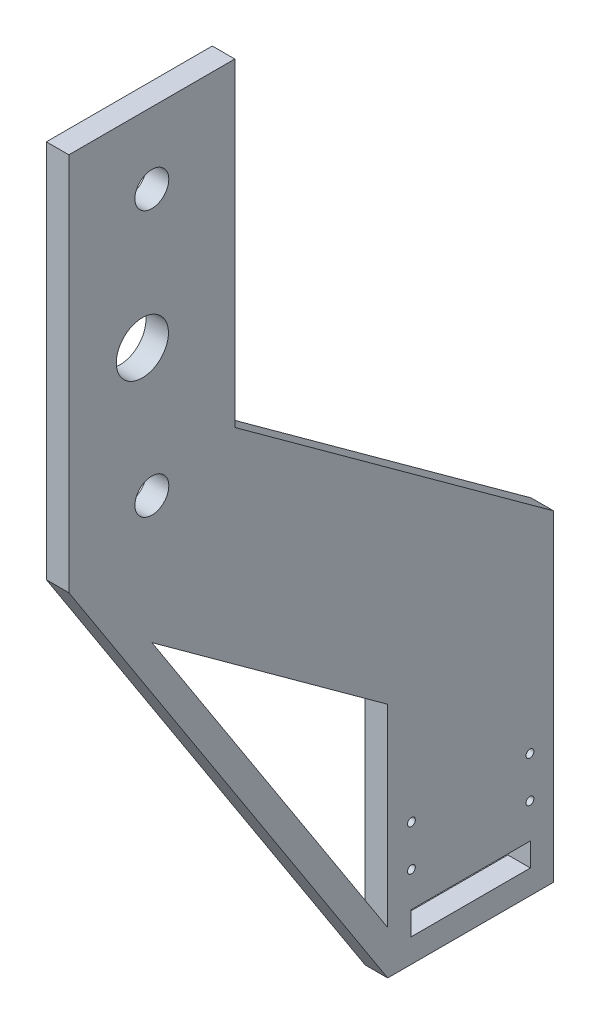
ISO-10303-21;
HEADER;
FILE_DESCRIPTION(('STEP AP214'),'2;1');
FILE_NAME('part.step','',(''),(''),'','','');
FILE_SCHEMA(('AUTOMOTIVE_DESIGN { 1 0 10303 214 1 1 1 1 }'));
ENDSEC;
DATA;
#1=APPLICATION_CONTEXT('core data for automotive mechanical design processes');
#2=APPLICATION_PROTOCOL_DEFINITION('international standard','automotive_design',2000,#1);
#3=PRODUCT_CONTEXT('',#1,'mechanical');
#4=PRODUCT('Part','Part','',(#3));
#5=PRODUCT_RELATED_PRODUCT_CATEGORY('part','',(#4));
#6=PRODUCT_DEFINITION_FORMATION('','',#4);
#7=PRODUCT_DEFINITION_CONTEXT('part definition',#1,'design');
#8=PRODUCT_DEFINITION('design','',#6,#7);
#9=PRODUCT_DEFINITION_SHAPE('','',#8);
#10=(LENGTH_UNIT() NAMED_UNIT(*) SI_UNIT(.MILLI.,.METRE.));
#11=(NAMED_UNIT(*) PLANE_ANGLE_UNIT() SI_UNIT($,.RADIAN.));
#12=(NAMED_UNIT(*) SI_UNIT($,.STERADIAN.) SOLID_ANGLE_UNIT());
#13=UNCERTAINTY_MEASURE_WITH_UNIT(LENGTH_MEASURE(1.E-05),#10,'distance_accuracy_value','');
#14=(GEOMETRIC_REPRESENTATION_CONTEXT(3) GLOBAL_UNCERTAINTY_ASSIGNED_CONTEXT((#13)) GLOBAL_UNIT_ASSIGNED_CONTEXT((#10,
#11,#12)) REPRESENTATION_CONTEXT('',''));
#15=CARTESIAN_POINT('',(0.,0.,0.));
#16=DIRECTION('',(0.,0.,1.));
#17=DIRECTION('',(1.,0.,0.));
#18=AXIS2_PLACEMENT_3D('',#15,#16,#17);
#19=CARTESIAN_POINT('',(9.5,0.,0.));
#20=DIRECTION('',(1.,0.,0.));
#21=DIRECTION('',(0.,0.,-1.));
#22=AXIS2_PLACEMENT_3D('',#19,#20,#21);
#23=PLANE('',#22);
#24=CARTESIAN_POINT('',(9.5,34.7,-10.));
#25=DIRECTION('',(1.,0.,0.));
#26=DIRECTION('',(0.,0.,-1.));
#27=AXIS2_PLACEMENT_3D('',#24,#25,#26);
#28=CIRCLE('',#27,1.64999999999999);
#29=CARTESIAN_POINT('',(9.5,34.7,-11.65));
#30=VERTEX_POINT('',#29);
#31=EDGE_CURVE('E422',#30,#30,#28,.T.);
#32=ORIENTED_EDGE('',*,*,#31,.F.);
#33=EDGE_LOOP('',(#32));
#34=FACE_BOUND('',#33,.T.);
#35=CARTESIAN_POINT('',(9.5,52.,-10.));
#36=DIRECTION('',(1.,0.,0.));
#37=DIRECTION('',(0.,0.,-1.));
#38=AXIS2_PLACEMENT_3D('',#35,#36,#37);
#39=CIRCLE('',#38,1.64999999999998);
#40=CARTESIAN_POINT('',(9.5,52.,-11.65));
#41=VERTEX_POINT('',#40);
#42=EDGE_CURVE('E426',#41,#41,#39,.T.);
#43=ORIENTED_EDGE('',*,*,#42,.F.);
#44=EDGE_LOOP('',(#43));
#45=FACE_BOUND('',#44,.T.);
#46=CARTESIAN_POINT('',(9.5,34.7,-60.));
#47=DIRECTION('',(1.,0.,0.));
#48=DIRECTION('',(0.,0.,-1.));
#49=AXIS2_PLACEMENT_3D('',#46,#47,#48);
#50=CIRCLE('',#49,1.64999999999999);
#51=CARTESIAN_POINT('',(9.5,34.7,-61.65));
#52=VERTEX_POINT('',#51);
#53=EDGE_CURVE('E436',#52,#52,#50,.T.);
#54=ORIENTED_EDGE('',*,*,#53,.F.);
#55=EDGE_LOOP('',(#54));
#56=FACE_BOUND('',#55,.T.);
#57=CARTESIAN_POINT('',(9.5,52.,-60.));
#58=DIRECTION('',(1.,0.,0.));
#59=DIRECTION('',(0.,0.,-1.));
#60=AXIS2_PLACEMENT_3D('',#57,#58,#59);
#61=CIRCLE('',#60,1.64999999999998);
#62=CARTESIAN_POINT('',(9.5,52.,-61.65));
#63=VERTEX_POINT('',#62);
#64=EDGE_CURVE('E444',#63,#63,#61,.T.);
#65=ORIENTED_EDGE('',*,*,#64,.F.);
#66=EDGE_LOOP('',(#65));
#67=FACE_BOUND('',#66,.T.);
#68=DIRECTION('',(0.,0.,-1.));
#69=VECTOR('',#68,1.);
#70=CARTESIAN_POINT('',(9.5,10.1,-9.8));
#71=LINE('',#70,#69);
#72=CARTESIAN_POINT('',(9.5,10.1,-9.8));
#73=VERTEX_POINT('',#72);
#74=CARTESIAN_POINT('',(9.5,10.1,-60.2));
#75=VERTEX_POINT('',#74);
#76=EDGE_CURVE('E154',#73,#75,#71,.T.);
#77=ORIENTED_EDGE('',*,*,#76,.F.);
#78=DIRECTION('',(0.,-1.,0.));
#79=VECTOR('',#78,1.);
#80=CARTESIAN_POINT('',(9.5,20.,-9.8));
#81=LINE('',#80,#79);
#82=CARTESIAN_POINT('',(9.5,20.,-9.8));
#83=VERTEX_POINT('',#82);
#84=EDGE_CURVE('E145',#83,#73,#81,.T.);
#85=ORIENTED_EDGE('',*,*,#84,.F.);
#86=DIRECTION('',(0.,0.,1.));
#87=VECTOR('',#86,1.);
#88=CARTESIAN_POINT('',(9.5,20.,-9.8));
#89=LINE('',#88,#87);
#90=CARTESIAN_POINT('',(9.5,20.,-60.2));
#91=VERTEX_POINT('',#90);
#92=EDGE_CURVE('E172',#91,#83,#89,.T.);
#93=ORIENTED_EDGE('',*,*,#92,.F.);
#94=DIRECTION('',(0.,1.,0.));
#95=VECTOR('',#94,1.);
#96=CARTESIAN_POINT('',(9.5,20.,-60.2));
#97=LINE('',#96,#95);
#98=EDGE_CURVE('E168',#75,#91,#97,.T.);
#99=ORIENTED_EDGE('',*,*,#98,.F.);
#100=EDGE_LOOP('',(#77,#85,#93,#99));
#101=FACE_BOUND('',#100,.T.);
#102=CARTESIAN_POINT('',(9.5,226.,99.4999999999999));
#103=DIRECTION('',(1.,0.,0.));
#104=DIRECTION('',(0.,0.,-1.));
#105=AXIS2_PLACEMENT_3D('',#102,#103,#104);
#106=CIRCLE('',#105,7.15);
#107=CARTESIAN_POINT('',(9.5,226.,92.35));
#108=VERTEX_POINT('',#107);
#109=EDGE_CURVE('E196',#108,#108,#106,.T.);
#110=ORIENTED_EDGE('',*,*,#109,.F.);
#111=EDGE_LOOP('',(#110));
#112=FACE_BOUND('',#111,.T.);
#113=DIRECTION('',(0.,-0.839732591318498,-0.543000161213163));
#114=VECTOR('',#113,1.);
#115=CARTESIAN_POINT('',(9.5,172.289806741815,99.4999999999999));
#116=LINE('',#115,#114);
#117=CARTESIAN_POINT('',(9.5,172.289806741815,99.4999999999999));
#118=VERTEX_POINT('',#117);
#119=CARTESIAN_POINT('',(9.5,18.41620079386,0.));
#120=VERTEX_POINT('',#119);
#121=EDGE_CURVE('E215',#118,#120,#116,.T.);
#122=ORIENTED_EDGE('',*,*,#121,.F.);
#123=DIRECTION('',(0.,0.587779000342478,0.809021536645594));
#124=VECTOR('',#123,1.);
#125=CARTESIAN_POINT('',(9.5,100.,0.));
#126=LINE('',#125,#124);
#127=CARTESIAN_POINT('',(9.5,100.,0.));
#128=VERTEX_POINT('',#127);
#129=EDGE_CURVE('E212',#128,#118,#126,.T.);
#130=ORIENTED_EDGE('',*,*,#129,.F.);
#131=DIRECTION('',(0.,1.,0.));
#132=VECTOR('',#131,1.);
#133=CARTESIAN_POINT('',(9.5,18.41620079386,0.));
#134=LINE('',#133,#132);
#135=EDGE_CURVE('E220',#120,#128,#134,.T.);
#136=ORIENTED_EDGE('',*,*,#135,.F.);
#137=EDGE_LOOP('',(#122,#130,#136));
#138=FACE_BOUND('',#137,.T.);
#139=DIRECTION('',(0.,-0.839732591318498,-0.543000161213163));
#140=VECTOR('',#139,1.);
#141=CARTESIAN_POINT('',(9.5,208.,134.5));
#142=LINE('',#141,#140);
#143=CARTESIAN_POINT('',(9.5,208.,134.5));
#144=VERTEX_POINT('',#143);
#145=CARTESIAN_POINT('',(9.5,0.,0.));
#146=VERTEX_POINT('',#145);
#147=EDGE_CURVE('E245',#144,#146,#142,.T.);
#148=ORIENTED_EDGE('',*,*,#147,.T.);
#149=DIRECTION('',(0.,0.,-1.));
#150=VECTOR('',#149,1.);
#151=CARTESIAN_POINT('',(9.5,0.,0.));
#152=LINE('',#151,#150);
#153=CARTESIAN_POINT('',(9.5,0.,-70.));
#154=VERTEX_POINT('',#153);
#155=EDGE_CURVE('E249',#146,#154,#152,.T.);
#156=ORIENTED_EDGE('',*,*,#155,.T.);
#157=DIRECTION('',(0.,1.,0.));
#158=VECTOR('',#157,1.);
#159=CARTESIAN_POINT('',(9.5,0.,-70.));
#160=LINE('',#159,#158);
#161=CARTESIAN_POINT('',(9.5,135.667122158044,-70.));
#162=VERTEX_POINT('',#161);
#163=EDGE_CURVE('E253',#154,#162,#160,.T.);
#164=ORIENTED_EDGE('',*,*,#163,.T.);
#165=DIRECTION('',(0.,0.587779000342478,0.809021536645594));
#166=VECTOR('',#165,1.);
#167=CARTESIAN_POINT('',(9.5,135.667122158044,-70.));
#168=LINE('',#167,#166);
#169=CARTESIAN_POINT('',(9.5,233.385504135674,64.4999999999999));
#170=VERTEX_POINT('',#169);
#171=EDGE_CURVE('E256',#162,#170,#168,.T.);
#172=ORIENTED_EDGE('',*,*,#171,.T.);
#173=DIRECTION('',(0.,1.,0.));
#174=VECTOR('',#173,1.);
#175=CARTESIAN_POINT('',(9.5,368.,64.5));
#176=LINE('',#175,#174);
#177=CARTESIAN_POINT('',(9.5,368.,64.5));
#178=VERTEX_POINT('',#177);
#179=EDGE_CURVE('E259',#170,#178,#176,.T.);
#180=ORIENTED_EDGE('',*,*,#179,.T.);
#181=DIRECTION('',(0.,0.,1.));
#182=VECTOR('',#181,1.);
#183=CARTESIAN_POINT('',(9.5,368.,134.5));
#184=LINE('',#183,#182);
#185=CARTESIAN_POINT('',(9.5,368.,134.5));
#186=VERTEX_POINT('',#185);
#187=EDGE_CURVE('E262',#178,#186,#184,.T.);
#188=ORIENTED_EDGE('',*,*,#187,.T.);
#189=DIRECTION('',(0.,-1.,0.));
#190=VECTOR('',#189,1.);
#191=CARTESIAN_POINT('',(9.5,208.,134.5));
#192=LINE('',#191,#190);
#193=EDGE_CURVE('E265',#186,#144,#192,.T.);
#194=ORIENTED_EDGE('',*,*,#193,.T.);
#195=EDGE_LOOP('',(#148,#156,#164,#172,#180,#188,#194));
#196=FACE_BOUND('',#195,.T.);
#197=CARTESIAN_POINT('',(9.5,338.,99.4999999999999));
#198=DIRECTION('',(1.,0.,0.));
#199=DIRECTION('',(0.,0.,-1.));
#200=AXIS2_PLACEMENT_3D('',#197,#198,#199);
#201=CIRCLE('',#200,7.15000000000001);
#202=CARTESIAN_POINT('',(9.5,338.,92.3499999999999));
#203=VERTEX_POINT('',#202);
#204=EDGE_CURVE('E204',#203,#203,#201,.T.);
#205=ORIENTED_EDGE('',*,*,#204,.F.);
#206=EDGE_LOOP('',(#205));
#207=FACE_BOUND('',#206,.T.);
#208=CARTESIAN_POINT('',(9.5,282.,103.5));
#209=DIRECTION('',(1.,0.,0.));
#210=DIRECTION('',(0.,0.,-1.));
#211=AXIS2_PLACEMENT_3D('',#208,#209,#210);
#212=CIRCLE('',#211,11.);
#213=CARTESIAN_POINT('',(9.5,282.,92.4999999999999));
#214=VERTEX_POINT('',#213);
#215=EDGE_CURVE('E180',#214,#214,#212,.T.);
#216=ORIENTED_EDGE('',*,*,#215,.F.);
#217=EDGE_LOOP('',(#216));
#218=FACE_BOUND('',#217,.T.);
#219=ADVANCED_FACE('F43',(#34,#45,#56,#67,#101,#112,#138,#196,#207,#218),#23,.T.);
#220=CARTESIAN_POINT('',(0.,0.,0.));
#221=DIRECTION('',(1.,0.,0.));
#222=DIRECTION('',(0.,0.,-1.));
#223=AXIS2_PLACEMENT_3D('',#220,#221,#222);
#224=PLANE('',#223);
#225=CARTESIAN_POINT('',(0.,34.7,-10.));
#226=DIRECTION('',(1.,0.,0.));
#227=DIRECTION('',(0.,0.,-1.));
#228=AXIS2_PLACEMENT_3D('',#225,#226,#227);
#229=CIRCLE('',#228,1.65);
#230=CARTESIAN_POINT('',(0.,34.7,-11.65));
#231=VERTEX_POINT('',#230);
#232=EDGE_CURVE('E420',#231,#231,#229,.T.);
#233=ORIENTED_EDGE('',*,*,#232,.T.);
#234=EDGE_LOOP('',(#233));
#235=FACE_BOUND('',#234,.T.);
#236=CARTESIAN_POINT('',(0.,52.,-10.));
#237=DIRECTION('',(1.,0.,0.));
#238=DIRECTION('',(0.,0.,-1.));
#239=AXIS2_PLACEMENT_3D('',#236,#237,#238);
#240=CIRCLE('',#239,1.65);
#241=CARTESIAN_POINT('',(0.,52.,-11.65));
#242=VERTEX_POINT('',#241);
#243=EDGE_CURVE('E432',#242,#242,#240,.T.);
#244=ORIENTED_EDGE('',*,*,#243,.T.);
#245=EDGE_LOOP('',(#244));
#246=FACE_BOUND('',#245,.T.);
#247=CARTESIAN_POINT('',(0.,34.7,-60.));
#248=DIRECTION('',(1.,0.,0.));
#249=DIRECTION('',(0.,0.,-1.));
#250=AXIS2_PLACEMENT_3D('',#247,#248,#249);
#251=CIRCLE('',#250,1.65);
#252=CARTESIAN_POINT('',(0.,34.7,-61.65));
#253=VERTEX_POINT('',#252);
#254=EDGE_CURVE('E440',#253,#253,#251,.T.);
#255=ORIENTED_EDGE('',*,*,#254,.T.);
#256=EDGE_LOOP('',(#255));
#257=FACE_BOUND('',#256,.T.);
#258=CARTESIAN_POINT('',(0.,52.,-60.));
#259=DIRECTION('',(1.,0.,0.));
#260=DIRECTION('',(0.,0.,-1.));
#261=AXIS2_PLACEMENT_3D('',#258,#259,#260);
#262=CIRCLE('',#261,1.65);
#263=CARTESIAN_POINT('',(0.,52.,-61.65));
#264=VERTEX_POINT('',#263);
#265=EDGE_CURVE('E448',#264,#264,#262,.T.);
#266=ORIENTED_EDGE('',*,*,#265,.T.);
#267=EDGE_LOOP('',(#266));
#268=FACE_BOUND('',#267,.T.);
#269=CARTESIAN_POINT('',(0.,226.,99.4999999999999));
#270=DIRECTION('',(1.,0.,0.));
#271=DIRECTION('',(0.,0.,-1.));
#272=AXIS2_PLACEMENT_3D('',#269,#270,#271);
#273=CIRCLE('',#272,7.15);
#274=CARTESIAN_POINT('',(0.,226.,92.35));
#275=VERTEX_POINT('',#274);
#276=EDGE_CURVE('E163',#275,#275,#273,.T.);
#277=ORIENTED_EDGE('',*,*,#276,.T.);
#278=EDGE_LOOP('',(#277));
#279=FACE_BOUND('',#278,.T.);
#280=CARTESIAN_POINT('',(0.,338.,99.4999999999999));
#281=DIRECTION('',(1.,0.,0.));
#282=DIRECTION('',(0.,0.,-1.));
#283=AXIS2_PLACEMENT_3D('',#280,#281,#282);
#284=CIRCLE('',#283,7.15000000000001);
#285=CARTESIAN_POINT('',(0.,338.,92.3499999999999));
#286=VERTEX_POINT('',#285);
#287=EDGE_CURVE('E200',#286,#286,#284,.T.);
#288=ORIENTED_EDGE('',*,*,#287,.T.);
#289=EDGE_LOOP('',(#288));
#290=FACE_BOUND('',#289,.T.);
#291=DIRECTION('',(0.,0.587779000342478,0.809021536645594));
#292=VECTOR('',#291,1.);
#293=CARTESIAN_POINT('',(0.,100.,0.));
#294=LINE('',#293,#292);
#295=CARTESIAN_POINT('',(0.,100.,0.));
#296=VERTEX_POINT('',#295);
#297=CARTESIAN_POINT('',(0.,172.289806741815,99.4999999999999));
#298=VERTEX_POINT('',#297);
#299=EDGE_CURVE('E208',#296,#298,#294,.T.);
#300=ORIENTED_EDGE('',*,*,#299,.T.);
#301=DIRECTION('',(0.,-0.839732591318498,-0.543000161213163));
#302=VECTOR('',#301,1.);
#303=CARTESIAN_POINT('',(0.,172.289806741815,99.4999999999999));
#304=LINE('',#303,#302);
#305=CARTESIAN_POINT('',(0.,18.41620079386,0.));
#306=VERTEX_POINT('',#305);
#307=EDGE_CURVE('E227',#298,#306,#304,.T.);
#308=ORIENTED_EDGE('',*,*,#307,.T.);
#309=DIRECTION('',(0.,1.,0.));
#310=VECTOR('',#309,1.);
#311=CARTESIAN_POINT('',(0.,18.41620079386,0.));
#312=LINE('',#311,#310);
#313=EDGE_CURVE('E216',#306,#296,#312,.T.);
#314=ORIENTED_EDGE('',*,*,#313,.T.);
#315=EDGE_LOOP('',(#300,#308,#314));
#316=FACE_BOUND('',#315,.T.);
#317=DIRECTION('',(0.,-0.839732591318498,-0.543000161213163));
#318=VECTOR('',#317,1.);
#319=CARTESIAN_POINT('',(0.,208.,134.5));
#320=LINE('',#319,#318);
#321=CARTESIAN_POINT('',(0.,208.,134.5));
#322=VERTEX_POINT('',#321);
#323=CARTESIAN_POINT('',(0.,0.,0.));
#324=VERTEX_POINT('',#323);
#325=EDGE_CURVE('E244',#322,#324,#320,.T.);
#326=ORIENTED_EDGE('',*,*,#325,.F.);
#327=DIRECTION('',(0.,-1.,0.));
#328=VECTOR('',#327,1.);
#329=CARTESIAN_POINT('',(0.,208.,134.5));
#330=LINE('',#329,#328);
#331=CARTESIAN_POINT('',(0.,368.,134.5));
#332=VERTEX_POINT('',#331);
#333=EDGE_CURVE('E250',#332,#322,#330,.T.);
#334=ORIENTED_EDGE('',*,*,#333,.F.);
#335=DIRECTION('',(0.,0.,1.));
#336=VECTOR('',#335,1.);
#337=CARTESIAN_POINT('',(0.,368.,134.5));
#338=LINE('',#337,#336);
#339=CARTESIAN_POINT('',(0.,368.,64.5));
#340=VERTEX_POINT('',#339);
#341=EDGE_CURVE('E284',#340,#332,#338,.T.);
#342=ORIENTED_EDGE('',*,*,#341,.F.);
#343=DIRECTION('',(0.,1.,0.));
#344=VECTOR('',#343,1.);
#345=CARTESIAN_POINT('',(0.,368.,64.5));
#346=LINE('',#345,#344);
#347=CARTESIAN_POINT('',(0.,233.385504135674,64.4999999999999));
#348=VERTEX_POINT('',#347);
#349=EDGE_CURVE('E281',#348,#340,#346,.T.);
#350=ORIENTED_EDGE('',*,*,#349,.F.);
#351=DIRECTION('',(0.,0.587779000342478,0.809021536645594));
#352=VECTOR('',#351,1.);
#353=CARTESIAN_POINT('',(0.,135.667122158044,-70.));
#354=LINE('',#353,#352);
#355=CARTESIAN_POINT('',(0.,135.667122158044,-70.));
#356=VERTEX_POINT('',#355);
#357=EDGE_CURVE('E278',#356,#348,#354,.T.);
#358=ORIENTED_EDGE('',*,*,#357,.F.);
#359=DIRECTION('',(0.,1.,0.));
#360=VECTOR('',#359,1.);
#361=CARTESIAN_POINT('',(0.,0.,-70.));
#362=LINE('',#361,#360);
#363=CARTESIAN_POINT('',(0.,0.,-70.));
#364=VERTEX_POINT('',#363);
#365=EDGE_CURVE('E275',#364,#356,#362,.T.);
#366=ORIENTED_EDGE('',*,*,#365,.F.);
#367=DIRECTION('',(0.,0.,-1.));
#368=VECTOR('',#367,1.);
#369=CARTESIAN_POINT('',(0.,0.,0.));
#370=LINE('',#369,#368);
#371=EDGE_CURVE('E272',#324,#364,#370,.T.);
#372=ORIENTED_EDGE('',*,*,#371,.F.);
#373=EDGE_LOOP('',(#326,#334,#342,#350,#358,#366,#372));
#374=FACE_BOUND('',#373,.T.);
#375=DIRECTION('',(0.,-1.,0.));
#376=VECTOR('',#375,1.);
#377=CARTESIAN_POINT('',(0.,20.,-9.8));
#378=LINE('',#377,#376);
#379=CARTESIAN_POINT('',(0.,20.,-9.8));
#380=VERTEX_POINT('',#379);
#381=CARTESIAN_POINT('',(0.,10.1,-9.8));
#382=VERTEX_POINT('',#381);
#383=EDGE_CURVE('E67',#380,#382,#378,.T.);
#384=ORIENTED_EDGE('',*,*,#383,.T.);
#385=DIRECTION('',(0.,0.,-1.));
#386=VECTOR('',#385,1.);
#387=CARTESIAN_POINT('',(0.,10.1,-9.8));
#388=LINE('',#387,#386);
#389=CARTESIAN_POINT('',(0.,10.1,-60.2));
#390=VERTEX_POINT('',#389);
#391=EDGE_CURVE('E161',#382,#390,#388,.T.);
#392=ORIENTED_EDGE('',*,*,#391,.T.);
#393=DIRECTION('',(0.,1.,0.));
#394=VECTOR('',#393,1.);
#395=CARTESIAN_POINT('',(0.,20.,-60.2));
#396=LINE('',#395,#394);
#397=CARTESIAN_POINT('',(0.,20.,-60.2));
#398=VERTEX_POINT('',#397);
#399=EDGE_CURVE('E183',#390,#398,#396,.T.);
#400=ORIENTED_EDGE('',*,*,#399,.T.);
#401=DIRECTION('',(0.,0.,1.));
#402=VECTOR('',#401,1.);
#403=CARTESIAN_POINT('',(0.,20.,-9.8));
#404=LINE('',#403,#402);
#405=EDGE_CURVE('E155',#398,#380,#404,.T.);
#406=ORIENTED_EDGE('',*,*,#405,.T.);
#407=EDGE_LOOP('',(#384,#392,#400,#406));
#408=FACE_BOUND('',#407,.T.);
#409=CARTESIAN_POINT('',(0.,282.,103.5));
#410=DIRECTION('',(1.,0.,0.));
#411=DIRECTION('',(0.,0.,-1.));
#412=AXIS2_PLACEMENT_3D('',#409,#410,#411);
#413=CIRCLE('',#412,11.);
#414=CARTESIAN_POINT('',(0.,282.,92.4999999999999));
#415=VERTEX_POINT('',#414);
#416=EDGE_CURVE('E452',#415,#415,#413,.T.);
#417=ORIENTED_EDGE('',*,*,#416,.T.);
#418=EDGE_LOOP('',(#417));
#419=FACE_BOUND('',#418,.T.);
#420=ADVANCED_FACE('F319',(#235,#246,#257,#268,#279,#290,#316,#374,#408,#419),#224,.F.);
#421=CARTESIAN_POINT('',(9.5,208.,134.5));
#422=DIRECTION('',(0.,0.543000161213163,-0.839732591318498));
#423=DIRECTION('',(0.,0.839732591318498,0.543000161213163));
#424=AXIS2_PLACEMENT_3D('',#421,#422,#423);
#425=PLANE('',#424);
#426=ORIENTED_EDGE('',*,*,#325,.T.);
#427=DIRECTION('',(-1.,0.,0.));
#428=VECTOR('',#427,1.);
#429=CARTESIAN_POINT('',(9.5,0.,0.));
#430=LINE('',#429,#428);
#431=EDGE_CURVE('E11',#146,#324,#430,.T.);
#432=ORIENTED_EDGE('',*,*,#431,.F.);
#433=ORIENTED_EDGE('',*,*,#147,.F.);
#434=DIRECTION('',(-1.,0.,0.));
#435=VECTOR('',#434,1.);
#436=CARTESIAN_POINT('',(9.5,208.,134.5));
#437=LINE('',#436,#435);
#438=EDGE_CURVE('E268',#144,#322,#437,.T.);
#439=ORIENTED_EDGE('',*,*,#438,.T.);
#440=EDGE_LOOP('',(#426,#432,#433,#439));
#441=FACE_BOUND('',#440,.T.);
#442=ADVANCED_FACE('F45',(#441),#425,.F.);
#443=CARTESIAN_POINT('',(9.5,0.,0.));
#444=DIRECTION('',(0.,1.,0.));
#445=DIRECTION('',(0.,0.,1.));
#446=AXIS2_PLACEMENT_3D('',#443,#444,#445);
#447=PLANE('',#446);
#448=ORIENTED_EDGE('',*,*,#371,.T.);
#449=DIRECTION('',(-1.,0.,0.));
#450=VECTOR('',#449,1.);
#451=CARTESIAN_POINT('',(9.5,0.,-70.));
#452=LINE('',#451,#450);
#453=EDGE_CURVE('E52',#154,#364,#452,.T.);
#454=ORIENTED_EDGE('',*,*,#453,.F.);
#455=ORIENTED_EDGE('',*,*,#155,.F.);
#456=ORIENTED_EDGE('',*,*,#431,.T.);
#457=EDGE_LOOP('',(#448,#454,#455,#456));
#458=FACE_BOUND('',#457,.T.);
#459=ADVANCED_FACE('F337',(#458),#447,.F.);
#460=CARTESIAN_POINT('',(9.5,0.,-70.));
#461=DIRECTION('',(0.,0.,1.));
#462=DIRECTION('',(1.,0.,0.));
#463=AXIS2_PLACEMENT_3D('',#460,#461,#462);
#464=PLANE('',#463);
#465=ORIENTED_EDGE('',*,*,#365,.T.);
#466=DIRECTION('',(-1.,0.,0.));
#467=VECTOR('',#466,1.);
#468=CARTESIAN_POINT('',(9.5,135.667122158044,-70.));
#469=LINE('',#468,#467);
#470=EDGE_CURVE('E304',#162,#356,#469,.T.);
#471=ORIENTED_EDGE('',*,*,#470,.F.);
#472=ORIENTED_EDGE('',*,*,#163,.F.);
#473=ORIENTED_EDGE('',*,*,#453,.T.);
#474=EDGE_LOOP('',(#465,#471,#472,#473));
#475=FACE_BOUND('',#474,.T.);
#476=ADVANCED_FACE('F313',(#475),#464,.F.);
#477=CARTESIAN_POINT('',(9.5,135.667122158044,-70.));
#478=DIRECTION('',(0.,-0.809021536645594,0.587779000342478));
#479=DIRECTION('',(0.,-0.587779000342478,-0.809021536645594));
#480=AXIS2_PLACEMENT_3D('',#477,#478,#479);
#481=PLANE('',#480);
#482=ORIENTED_EDGE('',*,*,#357,.T.);
#483=DIRECTION('',(-1.,0.,0.));
#484=VECTOR('',#483,1.);
#485=CARTESIAN_POINT('',(9.5,233.385504135674,64.4999999999999));
#486=LINE('',#485,#484);
#487=EDGE_CURVE('E300',#170,#348,#486,.T.);
#488=ORIENTED_EDGE('',*,*,#487,.F.);
#489=ORIENTED_EDGE('',*,*,#171,.F.);
#490=ORIENTED_EDGE('',*,*,#470,.T.);
#491=EDGE_LOOP('',(#482,#488,#489,#490));
#492=FACE_BOUND('',#491,.T.);
#493=ADVANCED_FACE('F325',(#492),#481,.F.);
#494=CARTESIAN_POINT('',(9.5,368.,64.5));
#495=DIRECTION('',(0.,0.,1.));
#496=DIRECTION('',(0.,-1.,0.));
#497=AXIS2_PLACEMENT_3D('',#494,#495,#496);
#498=PLANE('',#497);
#499=ORIENTED_EDGE('',*,*,#349,.T.);
#500=DIRECTION('',(-1.,0.,0.));
#501=VECTOR('',#500,1.);
#502=CARTESIAN_POINT('',(9.5,368.,64.5));
#503=LINE('',#502,#501);
#504=EDGE_CURVE('E296',#178,#340,#503,.T.);
#505=ORIENTED_EDGE('',*,*,#504,.F.);
#506=ORIENTED_EDGE('',*,*,#179,.F.);
#507=ORIENTED_EDGE('',*,*,#487,.T.);
#508=EDGE_LOOP('',(#499,#505,#506,#507));
#509=FACE_BOUND('',#508,.T.);
#510=ADVANCED_FACE('F329',(#509),#498,.F.);
#511=CARTESIAN_POINT('',(9.5,368.,134.5));
#512=DIRECTION('',(0.,-1.,0.));
#513=DIRECTION('',(0.,0.,-1.));
#514=AXIS2_PLACEMENT_3D('',#511,#512,#513);
#515=PLANE('',#514);
#516=ORIENTED_EDGE('',*,*,#341,.T.);
#517=DIRECTION('',(-1.,0.,0.));
#518=VECTOR('',#517,1.);
#519=CARTESIAN_POINT('',(9.5,368.,134.5));
#520=LINE('',#519,#518);
#521=EDGE_CURVE('E292',#186,#332,#520,.T.);
#522=ORIENTED_EDGE('',*,*,#521,.F.);
#523=ORIENTED_EDGE('',*,*,#187,.F.);
#524=ORIENTED_EDGE('',*,*,#504,.T.);
#525=EDGE_LOOP('',(#516,#522,#523,#524));
#526=FACE_BOUND('',#525,.T.);
#527=ADVANCED_FACE('F345',(#526),#515,.F.);
#528=CARTESIAN_POINT('',(9.5,208.,134.5));
#529=DIRECTION('',(0.,0.,-1.));
#530=DIRECTION('',(-1.,0.,0.));
#531=AXIS2_PLACEMENT_3D('',#528,#529,#530);
#532=PLANE('',#531);
#533=ORIENTED_EDGE('',*,*,#333,.T.);
#534=ORIENTED_EDGE('',*,*,#438,.F.);
#535=ORIENTED_EDGE('',*,*,#193,.F.);
#536=ORIENTED_EDGE('',*,*,#521,.T.);
#537=EDGE_LOOP('',(#533,#534,#535,#536));
#538=FACE_BOUND('',#537,.T.);
#539=ADVANCED_FACE('F342',(#538),#532,.F.);
#540=CARTESIAN_POINT('',(9.5,100.,0.));
#541=DIRECTION('',(0.,-0.809021536645594,0.587779000342478));
#542=DIRECTION('',(0.,-0.587779000342478,-0.809021536645594));
#543=AXIS2_PLACEMENT_3D('',#540,#541,#542);
#544=PLANE('',#543);
#545=ORIENTED_EDGE('',*,*,#299,.F.);
#546=DIRECTION('',(-1.,0.,0.));
#547=VECTOR('',#546,1.);
#548=CARTESIAN_POINT('',(9.5,100.,0.));
#549=LINE('',#548,#547);
#550=EDGE_CURVE('E223',#128,#296,#549,.T.);
#551=ORIENTED_EDGE('',*,*,#550,.F.);
#552=ORIENTED_EDGE('',*,*,#129,.T.);
#553=DIRECTION('',(-1.,0.,0.));
#554=VECTOR('',#553,1.);
#555=CARTESIAN_POINT('',(9.5,172.289806741815,99.4999999999999));
#556=LINE('',#555,#554);
#557=EDGE_CURVE('E240',#118,#298,#556,.T.);
#558=ORIENTED_EDGE('',*,*,#557,.T.);
#559=EDGE_LOOP('',(#545,#551,#552,#558));
#560=FACE_BOUND('',#559,.T.);
#561=ADVANCED_FACE('F352',(#560),#544,.T.);
#562=CARTESIAN_POINT('',(9.5,172.289806741815,99.4999999999999));
#563=DIRECTION('',(0.,0.543000161213163,-0.839732591318498));
#564=DIRECTION('',(0.,0.839732591318498,0.543000161213163));
#565=AXIS2_PLACEMENT_3D('',#562,#563,#564);
#566=PLANE('',#565);
#567=ORIENTED_EDGE('',*,*,#307,.F.);
#568=ORIENTED_EDGE('',*,*,#557,.F.);
#569=ORIENTED_EDGE('',*,*,#121,.T.);
#570=DIRECTION('',(-1.,0.,0.));
#571=VECTOR('',#570,1.);
#572=CARTESIAN_POINT('',(9.5,18.41620079386,0.));
#573=LINE('',#572,#571);
#574=EDGE_CURVE('E237',#120,#306,#573,.T.);
#575=ORIENTED_EDGE('',*,*,#574,.T.);
#576=EDGE_LOOP('',(#567,#568,#569,#575));
#577=FACE_BOUND('',#576,.T.);
#578=ADVANCED_FACE('F368',(#577),#566,.T.);
#579=CARTESIAN_POINT('',(9.5,18.41620079386,0.));
#580=DIRECTION('',(0.,0.,1.));
#581=DIRECTION('',(1.,0.,0.));
#582=AXIS2_PLACEMENT_3D('',#579,#580,#581);
#583=PLANE('',#582);
#584=ORIENTED_EDGE('',*,*,#313,.F.);
#585=ORIENTED_EDGE('',*,*,#574,.F.);
#586=ORIENTED_EDGE('',*,*,#135,.T.);
#587=ORIENTED_EDGE('',*,*,#550,.T.);
#588=EDGE_LOOP('',(#584,#585,#586,#587));
#589=FACE_BOUND('',#588,.T.);
#590=ADVANCED_FACE('F372',(#589),#583,.T.);
#591=CARTESIAN_POINT('',(9.5,338.,99.4999999999999));
#592=DIRECTION('',(-1.,0.,0.));
#593=DIRECTION('',(0.,0.,1.));
#594=AXIS2_PLACEMENT_3D('',#591,#592,#593);
#595=CYLINDRICAL_SURFACE('',#594,7.15000000000001);
#596=ORIENTED_EDGE('',*,*,#204,.T.);
#597=EDGE_LOOP('',(#596));
#598=FACE_BOUND('',#597,.T.);
#599=ORIENTED_EDGE('',*,*,#287,.F.);
#600=EDGE_LOOP('',(#599));
#601=FACE_BOUND('',#600,.T.);
#602=ADVANCED_FACE('F376',(#598,#601),#595,.F.);
#603=CARTESIAN_POINT('',(9.5,226.,99.4999999999999));
#604=DIRECTION('',(-1.,0.,0.));
#605=DIRECTION('',(0.,0.,1.));
#606=AXIS2_PLACEMENT_3D('',#603,#604,#605);
#607=CYLINDRICAL_SURFACE('',#606,7.15);
#608=ORIENTED_EDGE('',*,*,#109,.T.);
#609=EDGE_LOOP('',(#608));
#610=FACE_BOUND('',#609,.T.);
#611=ORIENTED_EDGE('',*,*,#276,.F.);
#612=EDGE_LOOP('',(#611));
#613=FACE_BOUND('',#612,.T.);
#614=ADVANCED_FACE('F380',(#610,#613),#607,.F.);
#615=CARTESIAN_POINT('',(9.5,20.,-9.8));
#616=DIRECTION('',(0.,0.,-1.));
#617=DIRECTION('',(-1.,0.,0.));
#618=AXIS2_PLACEMENT_3D('',#615,#616,#617);
#619=PLANE('',#618);
#620=ORIENTED_EDGE('',*,*,#383,.F.);
#621=DIRECTION('',(-1.,0.,0.));
#622=VECTOR('',#621,1.);
#623=CARTESIAN_POINT('',(9.5,20.,-9.8));
#624=LINE('',#623,#622);
#625=EDGE_CURVE('E149',#83,#380,#624,.T.);
#626=ORIENTED_EDGE('',*,*,#625,.F.);
#627=ORIENTED_EDGE('',*,*,#84,.T.);
#628=DIRECTION('',(-1.,0.,0.));
#629=VECTOR('',#628,1.);
#630=CARTESIAN_POINT('',(9.5,10.1,-9.8));
#631=LINE('',#630,#629);
#632=EDGE_CURVE('E148',#73,#382,#631,.T.);
#633=ORIENTED_EDGE('',*,*,#632,.T.);
#634=EDGE_LOOP('',(#620,#626,#627,#633));
#635=FACE_BOUND('',#634,.T.);
#636=ADVANCED_FACE('F147',(#635),#619,.T.);
#637=CARTESIAN_POINT('',(9.5,10.1,-9.8));
#638=DIRECTION('',(0.,1.,0.));
#639=DIRECTION('',(0.,0.,1.));
#640=AXIS2_PLACEMENT_3D('',#637,#638,#639);
#641=PLANE('',#640);
#642=ORIENTED_EDGE('',*,*,#391,.F.);
#643=ORIENTED_EDGE('',*,*,#632,.F.);
#644=ORIENTED_EDGE('',*,*,#76,.T.);
#645=DIRECTION('',(-1.,0.,0.));
#646=VECTOR('',#645,1.);
#647=CARTESIAN_POINT('',(9.5,10.1,-60.2));
#648=LINE('',#647,#646);
#649=EDGE_CURVE('E164',#75,#390,#648,.T.);
#650=ORIENTED_EDGE('',*,*,#649,.T.);
#651=EDGE_LOOP('',(#642,#643,#644,#650));
#652=FACE_BOUND('',#651,.T.);
#653=ADVANCED_FACE('F158',(#652),#641,.T.);
#654=CARTESIAN_POINT('',(9.5,20.,-60.2));
#655=DIRECTION('',(0.,0.,1.));
#656=DIRECTION('',(1.,0.,0.));
#657=AXIS2_PLACEMENT_3D('',#654,#655,#656);
#658=PLANE('',#657);
#659=ORIENTED_EDGE('',*,*,#399,.F.);
#660=ORIENTED_EDGE('',*,*,#649,.F.);
#661=ORIENTED_EDGE('',*,*,#98,.T.);
#662=DIRECTION('',(-1.,0.,0.));
#663=VECTOR('',#662,1.);
#664=CARTESIAN_POINT('',(9.5,20.,-60.2));
#665=LINE('',#664,#663);
#666=EDGE_CURVE('E59',#91,#398,#665,.T.);
#667=ORIENTED_EDGE('',*,*,#666,.T.);
#668=EDGE_LOOP('',(#659,#660,#661,#667));
#669=FACE_BOUND('',#668,.T.);
#670=ADVANCED_FACE('F389',(#669),#658,.T.);
#671=CARTESIAN_POINT('',(9.5,20.,-9.8));
#672=DIRECTION('',(0.,-1.,0.));
#673=DIRECTION('',(0.,0.,-1.));
#674=AXIS2_PLACEMENT_3D('',#671,#672,#673);
#675=PLANE('',#674);
#676=ORIENTED_EDGE('',*,*,#405,.F.);
#677=ORIENTED_EDGE('',*,*,#666,.F.);
#678=ORIENTED_EDGE('',*,*,#92,.T.);
#679=ORIENTED_EDGE('',*,*,#625,.T.);
#680=EDGE_LOOP('',(#676,#677,#678,#679));
#681=FACE_BOUND('',#680,.T.);
#682=ADVANCED_FACE('F392',(#681),#675,.T.);
#683=CARTESIAN_POINT('',(9.5,282.,103.5));
#684=DIRECTION('',(-1.,0.,0.));
#685=DIRECTION('',(0.,0.,1.));
#686=AXIS2_PLACEMENT_3D('',#683,#684,#685);
#687=CYLINDRICAL_SURFACE('',#686,11.);
#688=ORIENTED_EDGE('',*,*,#215,.T.);
#689=EDGE_LOOP('',(#688));
#690=FACE_BOUND('',#689,.T.);
#691=ORIENTED_EDGE('',*,*,#416,.F.);
#692=EDGE_LOOP('',(#691));
#693=FACE_BOUND('',#692,.T.);
#694=ADVANCED_FACE('F396',(#690,#693),#687,.F.);
#695=CARTESIAN_POINT('',(9.5,52.,-60.));
#696=DIRECTION('',(1.,0.,0.));
#697=DIRECTION('',(0.,0.,-1.));
#698=AXIS2_PLACEMENT_3D('',#695,#696,#697);
#699=CYLINDRICAL_SURFACE('',#698,1.64999999999999);
#700=ORIENTED_EDGE('',*,*,#265,.F.);
#701=EDGE_LOOP('',(#700));
#702=FACE_BOUND('',#701,.T.);
#703=ORIENTED_EDGE('',*,*,#64,.T.);
#704=EDGE_LOOP('',(#703));
#705=FACE_BOUND('',#704,.T.);
#706=ADVANCED_FACE('F399',(#702,#705),#699,.F.);
#707=CARTESIAN_POINT('',(9.5,34.7,-60.));
#708=DIRECTION('',(1.,0.,0.));
#709=DIRECTION('',(0.,0.,-1.));
#710=AXIS2_PLACEMENT_3D('',#707,#708,#709);
#711=CYLINDRICAL_SURFACE('',#710,1.65);
#712=ORIENTED_EDGE('',*,*,#254,.F.);
#713=EDGE_LOOP('',(#712));
#714=FACE_BOUND('',#713,.T.);
#715=ORIENTED_EDGE('',*,*,#53,.T.);
#716=EDGE_LOOP('',(#715));
#717=FACE_BOUND('',#716,.T.);
#718=ADVANCED_FACE('F403',(#714,#717),#711,.F.);
#719=CARTESIAN_POINT('',(9.5,52.,-10.));
#720=DIRECTION('',(1.,0.,0.));
#721=DIRECTION('',(0.,0.,-1.));
#722=AXIS2_PLACEMENT_3D('',#719,#720,#721);
#723=CYLINDRICAL_SURFACE('',#722,1.64999999999999);
#724=ORIENTED_EDGE('',*,*,#243,.F.);
#725=EDGE_LOOP('',(#724));
#726=FACE_BOUND('',#725,.T.);
#727=ORIENTED_EDGE('',*,*,#42,.T.);
#728=EDGE_LOOP('',(#727));
#729=FACE_BOUND('',#728,.T.);
#730=ADVANCED_FACE('F407',(#726,#729),#723,.F.);
#731=CARTESIAN_POINT('',(9.5,34.7,-10.));
#732=DIRECTION('',(1.,0.,0.));
#733=DIRECTION('',(0.,0.,-1.));
#734=AXIS2_PLACEMENT_3D('',#731,#732,#733);
#735=CYLINDRICAL_SURFACE('',#734,1.65);
#736=ORIENTED_EDGE('',*,*,#232,.F.);
#737=EDGE_LOOP('',(#736));
#738=FACE_BOUND('',#737,.T.);
#739=ORIENTED_EDGE('',*,*,#31,.T.);
#740=EDGE_LOOP('',(#739));
#741=FACE_BOUND('',#740,.T.);
#742=ADVANCED_FACE('F411',(#738,#741),#735,.F.);
#743=CLOSED_SHELL('',(#219,#420,#442,#459,#476,#493,#510,#527,#539,#561,#578,#590,#602,#614,
#636,#653,#670,#682,#694,#706,#718,#730,#742));
#744=MANIFOLD_SOLID_BREP('B2',#743);
#745=ADVANCED_BREP_SHAPE_REPRESENTATION('',(#18,#744),#14);
#746=SHAPE_DEFINITION_REPRESENTATION(#9,#745);
ENDSEC;
END-ISO-10303-21;
